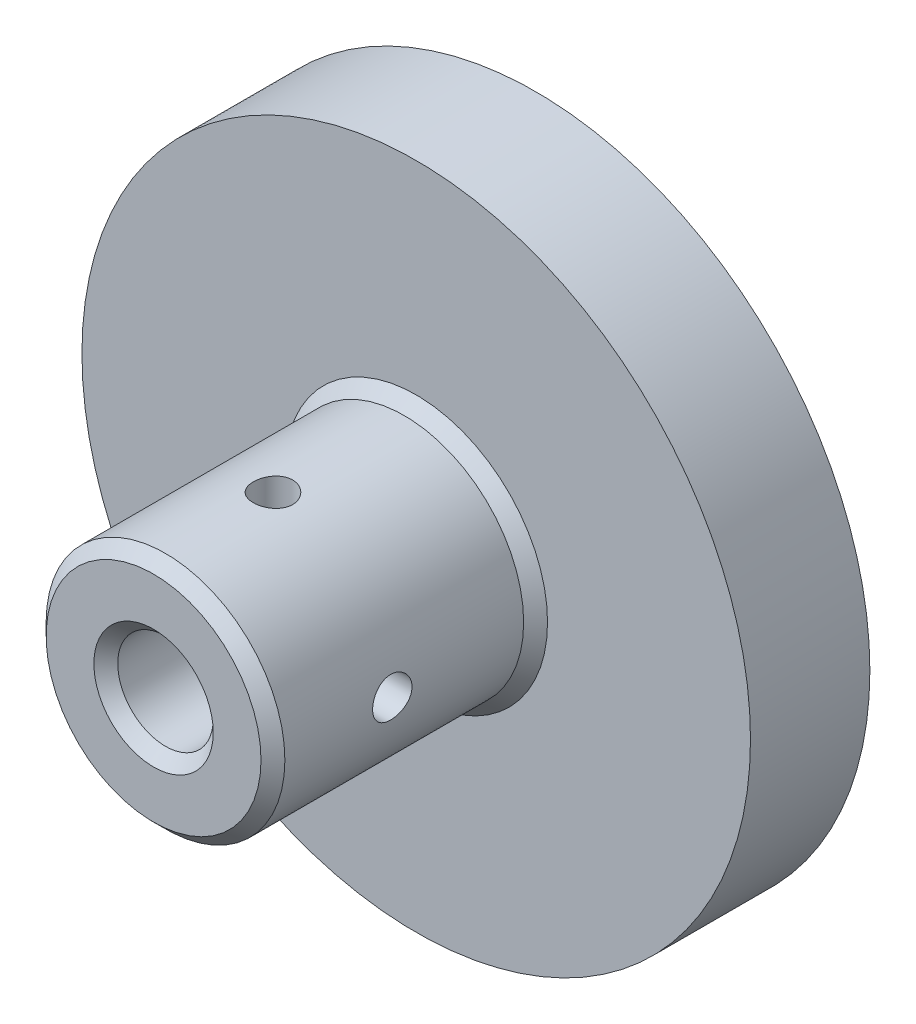
ISO-10303-21;
HEADER;
FILE_DESCRIPTION(('STEP AP214'),'2;1');
FILE_NAME('part.step','',(''),(''),'','','');
FILE_SCHEMA(('AUTOMOTIVE_DESIGN { 1 0 10303 214 1 1 1 1 }'));
ENDSEC;
DATA;
#1=APPLICATION_CONTEXT('core data for automotive mechanical design processes');
#2=APPLICATION_PROTOCOL_DEFINITION('international standard','automotive_design',2000,#1);
#3=PRODUCT_CONTEXT('',#1,'mechanical');
#4=PRODUCT('Part','Part','',(#3));
#5=PRODUCT_RELATED_PRODUCT_CATEGORY('part','',(#4));
#6=PRODUCT_DEFINITION_FORMATION('','',#4);
#7=PRODUCT_DEFINITION_CONTEXT('part definition',#1,'design');
#8=PRODUCT_DEFINITION('design','',#6,#7);
#9=PRODUCT_DEFINITION_SHAPE('','',#8);
#10=(LENGTH_UNIT() NAMED_UNIT(*) SI_UNIT(.MILLI.,.METRE.));
#11=(NAMED_UNIT(*) PLANE_ANGLE_UNIT() SI_UNIT($,.RADIAN.));
#12=(NAMED_UNIT(*) SI_UNIT($,.STERADIAN.) SOLID_ANGLE_UNIT());
#13=UNCERTAINTY_MEASURE_WITH_UNIT(LENGTH_MEASURE(1.E-05),#10,'distance_accuracy_value','');
#14=(GEOMETRIC_REPRESENTATION_CONTEXT(3) GLOBAL_UNCERTAINTY_ASSIGNED_CONTEXT((#13)) GLOBAL_UNIT_ASSIGNED_CONTEXT((#10,
#11,#12)) REPRESENTATION_CONTEXT('',''));
#15=CARTESIAN_POINT('',(0.,0.,0.));
#16=DIRECTION('',(0.,0.,1.));
#17=DIRECTION('',(1.,0.,0.));
#18=AXIS2_PLACEMENT_3D('',#15,#16,#17);
#19=CARTESIAN_POINT('',(0.,0.,10.));
#20=DIRECTION('',(0.,0.,-1.));
#21=DIRECTION('',(-1.,0.,0.));
#22=AXIS2_PLACEMENT_3D('',#19,#20,#21);
#23=CYLINDRICAL_SURFACE('',#22,28.);
#24=CARTESIAN_POINT('',(0.,0.,10.));
#25=DIRECTION('',(0.,0.,1.));
#26=DIRECTION('',(1.,0.,0.));
#27=AXIS2_PLACEMENT_3D('',#24,#25,#26);
#28=CIRCLE('',#27,28.);
#29=CARTESIAN_POINT('',(28.,0.,10.));
#30=VERTEX_POINT('',#29);
#31=EDGE_CURVE('E63',#30,#30,#28,.T.);
#32=ORIENTED_EDGE('',*,*,#31,.F.);
#33=EDGE_LOOP('',(#32));
#34=FACE_BOUND('',#33,.T.);
#35=CARTESIAN_POINT('',(0.,0.,0.));
#36=DIRECTION('',(0.,0.,1.));
#37=DIRECTION('',(1.,0.,0.));
#38=AXIS2_PLACEMENT_3D('',#35,#36,#37);
#39=CIRCLE('',#38,28.);
#40=CARTESIAN_POINT('',(28.,0.,0.));
#41=VERTEX_POINT('',#40);
#42=EDGE_CURVE('E64',#41,#41,#39,.T.);
#43=ORIENTED_EDGE('',*,*,#42,.T.);
#44=EDGE_LOOP('',(#43));
#45=FACE_BOUND('',#44,.T.);
#46=ADVANCED_FACE('F37',(#34,#45),#23,.T.);
#47=CARTESIAN_POINT('',(0.,0.,10.));
#48=DIRECTION('',(0.,0.,1.));
#49=DIRECTION('',(1.,0.,0.));
#50=AXIS2_PLACEMENT_3D('',#47,#48,#49);
#51=PLANE('',#50);
#52=CARTESIAN_POINT('',(0.,0.,10.));
#53=DIRECTION('',(0.,0.,1.));
#54=DIRECTION('',(1.,0.,0.));
#55=AXIS2_PLACEMENT_3D('',#52,#53,#54);
#56=CIRCLE('',#55,11.);
#57=CARTESIAN_POINT('',(11.,0.,10.));
#58=VERTEX_POINT('',#57);
#59=EDGE_CURVE('E10',#58,#58,#56,.F.);
#60=ORIENTED_EDGE('',*,*,#59,.T.);
#61=EDGE_LOOP('',(#60));
#62=FACE_BOUND('',#61,.T.);
#63=ORIENTED_EDGE('',*,*,#31,.T.);
#64=EDGE_LOOP('',(#63));
#65=FACE_BOUND('',#64,.T.);
#66=ADVANCED_FACE('F115',(#62,#65),#51,.T.);
#67=CARTESIAN_POINT('',(0.,0.,0.));
#68=DIRECTION('',(0.,0.,1.));
#69=DIRECTION('',(1.,0.,0.));
#70=AXIS2_PLACEMENT_3D('',#67,#68,#69);
#71=PLANE('',#70);
#72=CARTESIAN_POINT('',(0.,0.,0.));
#73=DIRECTION('',(0.,0.,1.));
#74=DIRECTION('',(1.,0.,0.));
#75=AXIS2_PLACEMENT_3D('',#72,#73,#74);
#76=CIRCLE('',#75,4.);
#77=CARTESIAN_POINT('',(4.,0.,0.));
#78=VERTEX_POINT('',#77);
#79=EDGE_CURVE('E67',#78,#78,#76,.T.);
#80=ORIENTED_EDGE('',*,*,#79,.T.);
#81=EDGE_LOOP('',(#80));
#82=FACE_BOUND('',#81,.T.);
#83=ORIENTED_EDGE('',*,*,#42,.F.);
#84=EDGE_LOOP('',(#83));
#85=FACE_BOUND('',#84,.T.);
#86=ADVANCED_FACE('F111',(#82,#85),#71,.F.);
#87=CARTESIAN_POINT('',(0.,0.,32.));
#88=DIRECTION('',(0.,0.,-1.));
#89=DIRECTION('',(-1.,0.,0.));
#90=AXIS2_PLACEMENT_3D('',#87,#88,#89);
#91=CYLINDRICAL_SURFACE('',#90,10.);
#92=CARTESIAN_POINT('',(10.,0.,20.35));
#93=CARTESIAN_POINT('',(9.99999843258099,-0.0920114531057513,20.3500037009853));
#94=CARTESIAN_POINT('',(9.99871684765511,-0.184073454347173,20.3577224586854));
#95=CARTESIAN_POINT('',(9.99372775496381,-0.36561632253533,20.3883812351379));
#96=CARTESIAN_POINT('',(9.99001800272159,-0.455094721351769,20.4113353369588));
#97=CARTESIAN_POINT('',(9.98058875631552,-0.628817487751617,20.4717536389359));
#98=CARTESIAN_POINT('',(9.974870893487,-0.713066038744489,20.5092060635603));
#99=CARTESIAN_POINT('',(9.96205444853338,-0.874072236504047,20.5975272541486));
#100=CARTESIAN_POINT('',(9.95495602786423,-0.950830757653335,20.648394451505));
#101=CARTESIAN_POINT('',(9.9400912001718,-1.09540879372213,20.7626087771329));
#102=CARTESIAN_POINT('',(9.93231968689365,-1.1631478788234,20.8260570636182));
#103=CARTESIAN_POINT('',(9.91702374723339,-1.28706950777736,20.9634147735932));
#104=CARTESIAN_POINT('',(9.90949933632427,-1.3432513290959,21.0373248506432));
#105=CARTESIAN_POINT('',(9.89550007731641,-1.44278500045255,21.1940593436766));
#106=CARTESIAN_POINT('',(9.88903182722124,-1.486057495709,21.2769347943439));
#107=CARTESIAN_POINT('',(9.87794796970923,-1.55803674048926,21.4489026252365));
#108=CARTESIAN_POINT('',(9.87333223970889,-1.58674445381558,21.5379945936492));
#109=CARTESIAN_POINT('',(9.86652679242373,-1.62852619503012,21.719014582001));
#110=CARTESIAN_POINT('',(9.86431555933323,-1.64173895927954,21.8109097556787));
#111=CARTESIAN_POINT('',(9.86250435770822,-1.6525858553069,21.9956373659234));
#112=CARTESIAN_POINT('',(9.86290420804218,-1.65022106770363,22.0884697370306));
#113=CARTESIAN_POINT('',(9.86625034802631,-1.63009303176281,22.2714472770567));
#114=CARTESIAN_POINT('',(9.86917088684506,-1.61248549472491,22.3616101140273));
#115=CARTESIAN_POINT('',(9.87718903199042,-1.56261607367814,22.5376840705334));
#116=CARTESIAN_POINT('',(9.88228671162732,-1.53035369619842,22.6235950467882));
#117=CARTESIAN_POINT('',(9.89411264039673,-1.45193210975576,22.7891935299244));
#118=CARTESIAN_POINT('',(9.90084846298693,-1.40570810605855,22.8688497892407));
#119=CARTESIAN_POINT('',(9.91518643931069,-1.30072141548382,23.0193343239077));
#120=CARTESIAN_POINT('',(9.92278866158315,-1.24195773629992,23.0901618999123));
#121=CARTESIAN_POINT('',(9.93811607123993,-1.11271072676608,23.2218799788826));
#122=CARTESIAN_POINT('',(9.94584163094155,-1.04209376928229,23.2826393946299));
#123=CARTESIAN_POINT('',(9.96045987838133,-0.891597059898627,23.3914660216062));
#124=CARTESIAN_POINT('',(9.9673525609492,-0.81171725050342,23.4395331540471));
#125=CARTESIAN_POINT('',(9.97953794169528,-0.644840083170818,23.5216221505343));
#126=CARTESIAN_POINT('',(9.98482933722618,-0.557837003156625,23.555632587638));
#127=CARTESIAN_POINT('',(9.99320544362233,-0.379246930002538,23.6085219127753));
#128=CARTESIAN_POINT('',(9.99629033536768,-0.28766031326089,23.6274020411448));
#129=CARTESIAN_POINT('',(9.99988156603306,-0.10363298381923,23.6493174611612));
#130=CARTESIAN_POINT('',(10.0004171933872,-0.0112142564119049,23.6525327361215));
#131=CARTESIAN_POINT('',(9.99892971175882,0.172841505554612,23.6435068013197));
#132=CARTESIAN_POINT('',(9.99690669920295,0.264478569441094,23.6312661740395));
#133=CARTESIAN_POINT('',(9.99054737820398,0.443814955541701,23.5918255972229));
#134=CARTESIAN_POINT('',(9.98622483070292,0.531534371938234,23.5647146056917));
#135=CARTESIAN_POINT('',(9.97574921956607,0.701182959294526,23.4963976074449));
#136=CARTESIAN_POINT('',(9.96959605484328,0.783111810188923,23.4551908223383));
#137=CARTESIAN_POINT('',(9.95606928426947,0.939636398877187,23.359438680501));
#138=CARTESIAN_POINT('',(9.94868555427359,1.01416235726441,23.3047807140829));
#139=CARTESIAN_POINT('',(9.93354765732488,1.15304841333202,23.1838328509312));
#140=CARTESIAN_POINT('',(9.92579346406183,1.2174077875821,23.1175421271457));
#141=CARTESIAN_POINT('',(9.91069407401677,1.33479962911466,22.9744038936717));
#142=CARTESIAN_POINT('',(9.90335382329476,1.38771058951938,22.8974561289012));
#143=CARTESIAN_POINT('',(9.89000528724129,1.47985547415611,22.7356589529326));
#144=CARTESIAN_POINT('',(9.88399696030452,1.51908982562642,22.6508097886681));
#145=CARTESIAN_POINT('',(9.87402953570154,1.58258535747081,22.4759604675969));
#146=CARTESIAN_POINT('',(9.87006212213644,1.60690737863644,22.3859829002034));
#147=CARTESIAN_POINT('',(9.86460473721113,1.64007952798871,22.2031486882195));
#148=CARTESIAN_POINT('',(9.86311455516769,1.64893097191814,22.1102922891519));
#149=CARTESIAN_POINT('',(9.86278931217107,1.65087457438791,21.9255493586982));
#150=CARTESIAN_POINT('',(9.86392203182987,1.6441579678695,21.8336648398079));
#151=CARTESIAN_POINT('',(9.86864441177183,1.61556925478543,21.6523522481362));
#152=CARTESIAN_POINT('',(9.87223406454433,1.59369719454883,21.5629241678464));
#153=CARTESIAN_POINT('',(9.88145370519206,1.53549112071354,21.3891347575646));
#154=CARTESIAN_POINT('',(9.8870814149876,1.49917324977363,21.3047678925491));
#155=CARTESIAN_POINT('',(9.89974533231771,1.41312606218932,21.1432937331397));
#156=CARTESIAN_POINT('',(9.90678160742253,1.36339610211419,21.0661867872723));
#157=CARTESIAN_POINT('',(9.92157214136343,1.25125259966704,20.9204545023623));
#158=CARTESIAN_POINT('',(9.92933379899766,1.18869826623125,20.8519382401805));
#159=CARTESIAN_POINT('',(9.94464125601211,1.05297867490408,20.7263094001233));
#160=CARTESIAN_POINT('',(9.95218700513286,0.97981097009266,20.6691994592198));
#161=CARTESIAN_POINT('',(9.96627143049841,0.824354696103038,20.5676525774265));
#162=CARTESIAN_POINT('',(9.97280295936929,0.742007852048179,20.523303852022));
#163=CARTESIAN_POINT('',(9.98405342047581,0.57095958692379,20.4491366471937));
#164=CARTESIAN_POINT('',(9.98877416450827,0.482264623543759,20.4193036358748));
#165=CARTESIAN_POINT('',(9.99483601455804,0.327682758240926,20.3815206584732));
#166=CARTESIAN_POINT('',(9.99676220083327,0.262733066711098,20.3697192511855));
#167=CARTESIAN_POINT('',(9.99934474465587,0.13186422762594,20.3539576610669));
#168=CARTESIAN_POINT('',(10.0000011233775,0.0659450962546684,20.3499973474842));
#169=CARTESIAN_POINT('',(10.,0.,20.35));
#170=B_SPLINE_CURVE_WITH_KNOTS('',3,(#92,#93,#94,#95,#96,#97,#98,#99,#100,#101,#102,#103,#104,
#105,#106,#107,#108,#109,#110,#111,#112,#113,#114,#115,#116,#117,#118,#119,#120,#121,#122,#123,
#124,#125,#126,#127,#128,#129,#130,#131,#132,#133,#134,#135,#136,#137,#138,#139,#140,#141,#142,
#143,#144,#145,#146,#147,#148,#149,#150,#151,#152,#153,#154,#155,#156,#157,#158,#159,#160,#161,
#162,#163,#164,#165,#166,#167,#168,#169),.UNSPECIFIED.,.T.,.F.,(4,2,2,2,2,2,2,2,2,2,2,2,2,2,2,2,
2,2,2,2,2,2,2,2,2,2,2,2,2,2,2,2,2,2,2,2,2,2,4),(0.,0.275793319008918,0.551841928312972,
0.8276667998706,1.10345943314171,1.38156673144316,1.65969141110741,1.93949209608633,
2.21927426326044,2.49653175525206,2.77377001402269,3.04820914252877,3.32265751287872,
3.59839967320042,3.87416366201706,4.1532757240192,4.43238951858747,4.71172976565332,
4.991047110928,5.26714751096616,5.54323750600189,5.81769359979004,6.09216485190803,
6.36901711215385,6.64588906369257,6.92556925596458,7.20524071063227,7.48376340648032,
7.76226241335696,8.03735855216245,8.31245385002402,8.58724259883659,8.86204453269316,
9.14004258759617,9.41810483731131,9.69804546871317,9.97770526783281,10.1753710978727,
10.3730336317698),.UNSPECIFIED.);
#171=CARTESIAN_POINT('',(10.,0.,20.35));
#172=VERTEX_POINT('',#171);
#173=EDGE_CURVE('E232',#172,#172,#170,.T.);
#174=ORIENTED_EDGE('',*,*,#173,.T.);
#175=EDGE_LOOP('',(#174));
#176=FACE_BOUND('',#175,.T.);
#177=CARTESIAN_POINT('',(0.,10.,23.65));
#178=CARTESIAN_POINT('',(-0.0920114531057509,9.99999843258099,23.6499962990147));
#179=CARTESIAN_POINT('',(-0.184073454347172,9.99871684765511,23.6422775413146));
#180=CARTESIAN_POINT('',(-0.365616322535328,9.99372775496381,23.6116187648621));
#181=CARTESIAN_POINT('',(-0.455094721351767,9.9900180027216,23.5886646630412));
#182=CARTESIAN_POINT('',(-0.628817487751612,9.98058875631552,23.5282463610641));
#183=CARTESIAN_POINT('',(-0.71306603874448,9.974870893487,23.4907939364397));
#184=CARTESIAN_POINT('',(-0.874072236504036,9.96205444853338,23.4024727458514));
#185=CARTESIAN_POINT('',(-0.950830757653324,9.95495602786423,23.351605548495));
#186=CARTESIAN_POINT('',(-1.09540879372212,9.9400912001718,23.2373912228671));
#187=CARTESIAN_POINT('',(-1.16314787882339,9.93231968689365,23.1739429363817));
#188=CARTESIAN_POINT('',(-1.28706950777735,9.9170237472334,23.0365852264068));
#189=CARTESIAN_POINT('',(-1.34325132909588,9.90949933632427,22.9626751493568));
#190=CARTESIAN_POINT('',(-1.44278500045253,9.89550007731641,22.8059406563233));
#191=CARTESIAN_POINT('',(-1.48605749570898,9.88903182722124,22.7230652056561));
#192=CARTESIAN_POINT('',(-1.55803674048924,9.87794796970923,22.5510973747635));
#193=CARTESIAN_POINT('',(-1.58674445381555,9.8733322397089,22.4620054063507));
#194=CARTESIAN_POINT('',(-1.62852619503009,9.86652679242373,22.280985417999));
#195=CARTESIAN_POINT('',(-1.64173895927951,9.86431555933323,22.1890902443212));
#196=CARTESIAN_POINT('',(-1.65258585530686,9.86250435770823,22.0043626340766));
#197=CARTESIAN_POINT('',(-1.65022106770359,9.86290420804218,21.9115302629694));
#198=CARTESIAN_POINT('',(-1.63009303176277,9.86625034802632,21.7285527229433));
#199=CARTESIAN_POINT('',(-1.61248549472487,9.86917088684506,21.6383898859726));
#200=CARTESIAN_POINT('',(-1.56261607367809,9.87718903199043,21.4623159294666));
#201=CARTESIAN_POINT('',(-1.53035369619838,9.88228671162733,21.3764049532117));
#202=CARTESIAN_POINT('',(-1.45193210975571,9.89411264039674,21.2108064700756));
#203=CARTESIAN_POINT('',(-1.4057081060585,9.90084846298694,21.1311502107593));
#204=CARTESIAN_POINT('',(-1.30072141548377,9.9151864393107,20.9806656760923));
#205=CARTESIAN_POINT('',(-1.24195773629987,9.92278866158316,20.9098381000877));
#206=CARTESIAN_POINT('',(-1.11271072676603,9.93811607123993,20.7781200211173));
#207=CARTESIAN_POINT('',(-1.04209376928222,9.94584163094155,20.7173606053701));
#208=CARTESIAN_POINT('',(-0.891597059898563,9.96045987838133,20.6085339783937));
#209=CARTESIAN_POINT('',(-0.811717250503355,9.9673525609492,20.5604668459529));
#210=CARTESIAN_POINT('',(-0.644840083170752,9.97953794169528,20.4783778494657));
#211=CARTESIAN_POINT('',(-0.557837003156558,9.98482933722619,20.444367412362));
#212=CARTESIAN_POINT('',(-0.37924693000247,9.99320544362233,20.3914780872247));
#213=CARTESIAN_POINT('',(-0.287660313260821,9.99629033536768,20.3725979588552));
#214=CARTESIAN_POINT('',(-0.103632983819161,9.99988156603306,20.3506825388388));
#215=CARTESIAN_POINT('',(-0.0112142564118364,10.0004171933872,20.3474672638785));
#216=CARTESIAN_POINT('',(0.17284150555468,9.99892971175882,20.3564931986803));
#217=CARTESIAN_POINT('',(0.264478569441162,9.99690669920295,20.3687338259605));
#218=CARTESIAN_POINT('',(0.443814955541767,9.99054737820398,20.4081744027771));
#219=CARTESIAN_POINT('',(0.531534371938299,9.98622483070291,20.4352853943084));
#220=CARTESIAN_POINT('',(0.70118295929459,9.97574921956607,20.5036023925551));
#221=CARTESIAN_POINT('',(0.783111810188987,9.96959605484327,20.5448091776617));
#222=CARTESIAN_POINT('',(0.939636398877249,9.95606928426946,20.640561319499));
#223=CARTESIAN_POINT('',(1.01416235726447,9.94868555427359,20.6952192859171));
#224=CARTESIAN_POINT('',(1.15304841333208,9.93354765732487,20.8161671490688));
#225=CARTESIAN_POINT('',(1.21740778758216,9.92579346406183,20.8824578728543));
#226=CARTESIAN_POINT('',(1.33479962911471,9.91069407401676,21.0255961063283));
#227=CARTESIAN_POINT('',(1.38771058951943,9.90335382329476,21.1025438710988));
#228=CARTESIAN_POINT('',(1.47985547415616,9.89000528724129,21.2643410470675));
#229=CARTESIAN_POINT('',(1.51908982562647,9.88399696030451,21.3491902113319));
#230=CARTESIAN_POINT('',(1.58258535747086,9.87402953570153,21.5240395324031));
#231=CARTESIAN_POINT('',(1.60690737863648,9.87006212213643,21.6140170997967));
#232=CARTESIAN_POINT('',(1.64007952798875,9.86460473721113,21.7968513117806));
#233=CARTESIAN_POINT('',(1.64893097191818,9.86311455516768,21.8897077108482));
#234=CARTESIAN_POINT('',(1.65087457438795,9.86278931217107,22.0744506413018));
#235=CARTESIAN_POINT('',(1.64415796786953,9.86392203182987,22.1663351601921));
#236=CARTESIAN_POINT('',(1.61556925478546,9.86864441177183,22.3476477518639));
#237=CARTESIAN_POINT('',(1.59369719454886,9.87223406454433,22.4370758321536));
#238=CARTESIAN_POINT('',(1.53549112071356,9.88145370519205,22.6108652424354));
#239=CARTESIAN_POINT('',(1.49917324977365,9.88708141498759,22.695232107451));
#240=CARTESIAN_POINT('',(1.41312606218934,9.89974533231771,22.8567062668603));
#241=CARTESIAN_POINT('',(1.36339610211421,9.90678160742252,22.9338132127277));
#242=CARTESIAN_POINT('',(1.25125259966706,9.92157214136343,23.0795454976377));
#243=CARTESIAN_POINT('',(1.18869826623126,9.92933379899765,23.1480617598196));
#244=CARTESIAN_POINT('',(1.05297867490409,9.94464125601211,23.2736905998767));
#245=CARTESIAN_POINT('',(0.979810970092669,9.95218700513286,23.3308005407802));
#246=CARTESIAN_POINT('',(0.824354696103044,9.96627143049842,23.4323474225735));
#247=CARTESIAN_POINT('',(0.742007852048184,9.97280295936929,23.476696147978));
#248=CARTESIAN_POINT('',(0.570959586923792,9.98405342047581,23.5508633528063));
#249=CARTESIAN_POINT('',(0.482264623543761,9.98877416450827,23.5806963641252));
#250=CARTESIAN_POINT('',(0.327682758240928,9.99483601455804,23.6184793415268));
#251=CARTESIAN_POINT('',(0.2627330667111,9.99676220083327,23.6302807488145));
#252=CARTESIAN_POINT('',(0.131864227625941,9.99934474465587,23.6460423389331));
#253=CARTESIAN_POINT('',(0.065945096254669,10.0000011233775,23.6500026525158));
#254=CARTESIAN_POINT('',(0.,10.,23.65));
#255=B_SPLINE_CURVE_WITH_KNOTS('',3,(#177,#178,#179,#180,#181,#182,#183,#184,#185,#186,#187,
#188,#189,#190,#191,#192,#193,#194,#195,#196,#197,#198,#199,#200,#201,#202,#203,#204,#205,#206,
#207,#208,#209,#210,#211,#212,#213,#214,#215,#216,#217,#218,#219,#220,#221,#222,#223,#224,#225,
#226,#227,#228,#229,#230,#231,#232,#233,#234,#235,#236,#237,#238,#239,#240,#241,#242,#243,#244,
#245,#246,#247,#248,#249,#250,#251,#252,#253,#254),.UNSPECIFIED.,.T.,.F.,(4,2,2,2,2,2,2,2,2,2,2,
2,2,2,2,2,2,2,2,2,2,2,2,2,2,2,2,2,2,2,2,2,2,2,2,2,2,2,4),(0.,0.275793319008917,
0.551841928312971,0.827666799870593,1.1034594331417,1.38156673144315,1.65969141110741,
1.93949209608633,2.21927426326044,2.49653175525206,2.77377001402269,3.04820914252876,
3.32265751287871,3.59839967320041,3.87416366201706,4.1532757240192,4.43238951858747,
4.71172976565331,4.991047110928,5.26714751096616,5.54323750600189,5.81769359979003,
6.09216485190802,6.36901711215385,6.64588906369257,6.92556925596458,7.20524071063227,
7.48376340648031,7.76226241335695,8.03735855216244,8.31245385002402,8.58724259883658,
8.86204453269315,9.14004258759616,9.4181048373113,9.69804546871317,9.9777052678328,
10.1753710978727,10.3730336317698),.UNSPECIFIED.);
#256=CARTESIAN_POINT('',(0.,10.,23.65));
#257=VERTEX_POINT('',#256);
#258=EDGE_CURVE('E72',#257,#257,#255,.T.);
#259=ORIENTED_EDGE('',*,*,#258,.T.);
#260=EDGE_LOOP('',(#259));
#261=FACE_BOUND('',#260,.T.);
#262=CARTESIAN_POINT('',(0.,0.,11.));
#263=DIRECTION('',(0.,0.,1.));
#264=DIRECTION('',(1.,0.,0.));
#265=AXIS2_PLACEMENT_3D('',#262,#263,#264);
#266=CIRCLE('',#265,10.);
#267=CARTESIAN_POINT('',(10.,0.,11.));
#268=VERTEX_POINT('',#267);
#269=EDGE_CURVE('E44',#268,#268,#266,.T.);
#270=ORIENTED_EDGE('',*,*,#269,.T.);
#271=EDGE_LOOP('',(#270));
#272=FACE_BOUND('',#271,.T.);
#273=CARTESIAN_POINT('',(0.,0.,31.));
#274=DIRECTION('',(0.,0.,1.));
#275=DIRECTION('',(1.,0.,0.));
#276=AXIS2_PLACEMENT_3D('',#273,#274,#275);
#277=CIRCLE('',#276,10.);
#278=CARTESIAN_POINT('',(10.,0.,31.));
#279=VERTEX_POINT('',#278);
#280=EDGE_CURVE('E48',#279,#279,#277,.F.);
#281=ORIENTED_EDGE('',*,*,#280,.T.);
#282=EDGE_LOOP('',(#281));
#283=FACE_BOUND('',#282,.T.);
#284=ADVANCED_FACE('F86',(#176,#261,#272,#283),#91,.T.);
#285=CARTESIAN_POINT('',(0.,0.,32.));
#286=DIRECTION('',(0.,0.,1.));
#287=DIRECTION('',(1.,0.,0.));
#288=AXIS2_PLACEMENT_3D('',#285,#286,#287);
#289=PLANE('',#288);
#290=CARTESIAN_POINT('',(0.,0.,32.));
#291=DIRECTION('',(0.,0.,1.));
#292=DIRECTION('',(1.,0.,0.));
#293=AXIS2_PLACEMENT_3D('',#290,#291,#292);
#294=CIRCLE('',#293,5.00000000000001);
#295=CARTESIAN_POINT('',(5.00000000000001,0.,32.));
#296=VERTEX_POINT('',#295);
#297=EDGE_CURVE('E52',#296,#296,#294,.F.);
#298=ORIENTED_EDGE('',*,*,#297,.T.);
#299=EDGE_LOOP('',(#298));
#300=FACE_BOUND('',#299,.T.);
#301=CARTESIAN_POINT('',(0.,0.,32.));
#302=DIRECTION('',(0.,0.,1.));
#303=DIRECTION('',(1.,0.,0.));
#304=AXIS2_PLACEMENT_3D('',#301,#302,#303);
#305=CIRCLE('',#304,9.);
#306=CARTESIAN_POINT('',(9.,0.,32.));
#307=VERTEX_POINT('',#306);
#308=EDGE_CURVE('E57',#307,#307,#305,.T.);
#309=ORIENTED_EDGE('',*,*,#308,.T.);
#310=EDGE_LOOP('',(#309));
#311=FACE_BOUND('',#310,.T.);
#312=ADVANCED_FACE('F104',(#300,#311),#289,.T.);
#313=CARTESIAN_POINT('',(0.,0.,0.));
#314=DIRECTION('',(0.,0.,1.));
#315=DIRECTION('',(1.,0.,0.));
#316=AXIS2_PLACEMENT_3D('',#313,#314,#315);
#317=CYLINDRICAL_SURFACE('',#316,4.);
#318=CARTESIAN_POINT('',(4.,0.,20.35));
#319=CARTESIAN_POINT('',(3.99999309817074,0.0884596783632789,20.3500092172066));
#320=CARTESIAN_POINT('',(3.99703145792172,0.177062252057582,20.3571560143433));
#321=CARTESIAN_POINT('',(3.9854711320255,0.351759669836408,20.3854911419369));
#322=CARTESIAN_POINT('',(3.97685757767607,0.437847271996958,20.4067165110243));
#323=CARTESIAN_POINT('',(3.95491965529936,0.604702496902737,20.4622948122019));
#324=CARTESIAN_POINT('',(3.94161112398211,0.685486934491192,20.4966036433535));
#325=CARTESIAN_POINT('',(3.91158286286531,0.840076633223481,20.5771947578495));
#326=CARTESIAN_POINT('',(3.89486420463244,0.913884076117558,20.6234732811702));
#327=CARTESIAN_POINT('',(3.85876900012149,1.05618769598524,20.7291067546441));
#328=CARTESIAN_POINT('',(3.83930654387258,1.12429373957475,20.788957670249));
#329=CARTESIAN_POINT('',(3.80029483347099,1.24983574384756,20.918988839659));
#330=CARTESIAN_POINT('',(3.78074553976623,1.30726618926956,20.9891743992118));
#331=CARTESIAN_POINT('',(3.74272551686067,1.41254826809048,21.1419682488717));
#332=CARTESIAN_POINT('',(3.72435159658093,1.45980781790559,21.2250111153066));
#333=CARTESIAN_POINT('',(3.69212136090387,1.53951358199404,21.3987363092902));
#334=CARTESIAN_POINT('',(3.67826276509116,1.57196727712788,21.4894147513631));
#335=CARTESIAN_POINT('',(3.65756021871624,1.61953738222489,21.6713479970019));
#336=CARTESIAN_POINT('',(3.65041449103238,1.6354037141715,21.7623710721431));
#337=CARTESIAN_POINT('',(3.64307714795705,1.65168918120799,21.9460465073653));
#338=CARTESIAN_POINT('',(3.6428818057274,1.65211659473996,22.0386979676293));
#339=CARTESIAN_POINT('',(3.64921138579607,1.63807780779826,22.2155988866188));
#340=CARTESIAN_POINT('',(3.65523439741042,1.62472398487454,22.2999581587492));
#341=CARTESIAN_POINT('',(3.67247532251839,1.58536484231193,22.4651102843812));
#342=CARTESIAN_POINT('',(3.68369420783861,1.5593571558718,22.5459024676033));
#343=CARTESIAN_POINT('',(3.71031458481433,1.49492412942483,22.7036451087586));
#344=CARTESIAN_POINT('',(3.72579923184193,1.45624866973011,22.7804787378084));
#345=CARTESIAN_POINT('',(3.75918616236909,1.36775445443618,22.9268602324601));
#346=CARTESIAN_POINT('',(3.77708938726887,1.31793135478153,22.9964052422492));
#347=CARTESIAN_POINT('',(3.81509742396097,1.20371911924862,23.1322864077878));
#348=CARTESIAN_POINT('',(3.83526188253692,1.13846630094382,23.1978819577033));
#349=CARTESIAN_POINT('',(3.87426910607355,0.997682554866143,23.3174446744414));
#350=CARTESIAN_POINT('',(3.89311157289531,0.922149319847359,23.3714092238609));
#351=CARTESIAN_POINT('',(3.92787932271739,0.760736369737248,23.4672347735851));
#352=CARTESIAN_POINT('',(3.94373050716792,0.67466409407216,23.5088002831942));
#353=CARTESIAN_POINT('',(3.97016319816606,0.495928253552899,23.5766030241089));
#354=CARTESIAN_POINT('',(3.98074755693755,0.403268287372308,23.6028485532112));
#355=CARTESIAN_POINT('',(3.99492450637935,0.220181304317597,23.6377295036782));
#356=CARTESIAN_POINT('',(3.99891121146316,0.129974172308146,23.6473591779359));
#357=CARTESIAN_POINT('',(4.00069746426785,-0.0508474401522959,23.6516920437633));
#358=CARTESIAN_POINT('',(3.99849874371343,-0.141461799500638,23.6463994131082));
#359=CARTESIAN_POINT('',(3.98841747083846,-0.315907755487618,23.621754731757));
#360=CARTESIAN_POINT('',(3.98081531688809,-0.399855317526753,23.6030959266599));
#361=CARTESIAN_POINT('',(3.9609888780309,-0.563340473329641,23.5532079036629));
#362=CARTESIAN_POINT('',(3.94876400644331,-0.642877505872212,23.5219770901852));
#363=CARTESIAN_POINT('',(3.92039728883463,-0.798061975964539,23.4468106200191));
#364=CARTESIAN_POINT('',(3.90414585630854,-0.87351265666057,23.4025114382438));
#365=CARTESIAN_POINT('',(3.86946768187547,-1.01617847320913,23.3028660657421));
#366=CARTESIAN_POINT('',(3.85104004134397,-1.08339018342116,23.2475153049101));
#367=CARTESIAN_POINT('',(3.81240295844538,-1.21261994292747,23.122795695188));
#368=CARTESIAN_POINT('',(3.7921591649383,-1.27394364561828,23.0527161759607));
#369=CARTESIAN_POINT('',(3.75333928940829,-1.38414835482511,22.9029287093914));
#370=CARTESIAN_POINT('',(3.73476355904107,-1.43302674162732,22.8232187400574));
#371=CARTESIAN_POINT('',(3.70128700339841,-1.51742282291392,22.6549046294666));
#372=CARTESIAN_POINT('',(3.68643724424494,-1.55275802936539,22.5661980839919));
#373=CARTESIAN_POINT('',(3.66281640168179,-1.60769618165397,22.3832908340217));
#374=CARTESIAN_POINT('',(3.65404044124934,-1.62731175174757,22.2890946035818));
#375=CARTESIAN_POINT('',(3.64429559365238,-1.64901123940271,22.1055697268419));
#376=CARTESIAN_POINT('',(3.64278573581522,-1.65231049364128,22.016412780542));
#377=CARTESIAN_POINT('',(3.64631178238902,-1.6445148535657,21.8388715292408));
#378=CARTESIAN_POINT('',(3.65134672892695,-1.63342206561732,21.7504871130806));
#379=CARTESIAN_POINT('',(3.66690490418699,-1.59817118006574,21.5810669287423));
#380=CARTESIAN_POINT('',(3.6771726120025,-1.57461958437456,21.4998792885779));
#381=CARTESIAN_POINT('',(3.70184411206583,-1.51570599472929,21.3425854775259));
#382=CARTESIAN_POINT('',(3.7162490615217,-1.48034069596894,21.2664807357024));
#383=CARTESIAN_POINT('',(3.7486340889516,-1.39638062253792,21.1165779617586));
#384=CARTESIAN_POINT('',(3.76677577854002,-1.34712443599272,21.0431859289786));
#385=CARTESIAN_POINT('',(3.80412864636709,-1.23771718137823,20.9053283127357));
#386=CARTESIAN_POINT('',(3.82334018195056,-1.17756245772963,20.8408657372256));
#387=CARTESIAN_POINT('',(3.86230172013188,-1.04300738755744,20.7180058612963));
#388=CARTESIAN_POINT('',(3.88199359359226,-0.967900110730178,20.6603607763945));
#389=CARTESIAN_POINT('',(3.91832426905579,-0.808343463182033,20.5584598404613));
#390=CARTESIAN_POINT('',(3.9349616732268,-0.723889843442849,20.5142101136341));
#391=CARTESIAN_POINT('',(3.96305691394126,-0.549414760109626,20.4413362601652));
#392=CARTESIAN_POINT('',(3.97459855421812,-0.459513381649423,20.4124575746414));
#393=CARTESIAN_POINT('',(3.99154438775475,-0.27571922921324,20.3704889152149));
#394=CARTESIAN_POINT('',(3.99696786149576,-0.181839966818027,20.3573493337546));
#395=CARTESIAN_POINT('',(3.99968194626838,-0.0584442952271949,20.35077322967));
#396=CARTESIAN_POINT('',(4.00000228058838,-0.0292299486703373,20.3499969543358));
#397=CARTESIAN_POINT('',(4.,0.,20.35));
#398=B_SPLINE_CURVE_WITH_KNOTS('',3,(#318,#319,#320,#321,#322,#323,#324,#325,#326,#327,#328,
#329,#330,#331,#332,#333,#334,#335,#336,#337,#338,#339,#340,#341,#342,#343,#344,#345,#346,#347,
#348,#349,#350,#351,#352,#353,#354,#355,#356,#357,#358,#359,#360,#361,#362,#363,#364,#365,#366,
#367,#368,#369,#370,#371,#372,#373,#374,#375,#376,#377,#378,#379,#380,#381,#382,#383,#384,#385,
#386,#387,#388,#389,#390,#391,#392,#393,#394,#395,#396,#397),.UNSPECIFIED.,.T.,.F.,(4,2,2,2,2,2,
2,2,2,2,2,2,2,2,2,2,2,2,2,2,2,2,2,2,2,2,2,2,2,2,2,2,2,2,2,2,2,2,2,4),(0.,0.26529709877062,
0.531294937906659,0.79640398149888,1.06142984766523,1.33841878994456,1.61555043582129,
1.90598404924538,2.19627075414924,2.4727764853942,2.74913395037958,3.00480633611682,
3.26052656166859,3.5216353930134,3.78284615202014,4.06565185095455,4.34852112528508,
4.63767392136375,4.92666995726766,5.19768149557684,5.46861716672803,5.72643264660552,
5.98428085748382,6.25011488704504,6.51605907418431,6.80064580250401,7.08529238632157,
7.3736498522578,7.66177550895674,7.92807823226722,8.19434198489782,8.44869772098557,
8.70312467109942,8.97267479984707,9.24231550885211,9.5310408581654,9.81989801073176,
10.1038095613048,10.3868238858898,10.4744866574818),.UNSPECIFIED.);
#399=CARTESIAN_POINT('',(4.,0.,20.35));
#400=VERTEX_POINT('',#399);
#401=EDGE_CURVE('E228',#400,#400,#398,.T.);
#402=ORIENTED_EDGE('',*,*,#401,.T.);
#403=EDGE_LOOP('',(#402));
#404=FACE_BOUND('',#403,.T.);
#405=CARTESIAN_POINT('',(0.,4.,23.65));
#406=CARTESIAN_POINT('',(0.0884596783632783,3.99999309817074,23.6499907827934));
#407=CARTESIAN_POINT('',(0.177062252057581,3.99703145792172,23.6428439856567));
#408=CARTESIAN_POINT('',(0.351759669836407,3.9854711320255,23.6145088580631));
#409=CARTESIAN_POINT('',(0.437847271996959,3.97685757767606,23.5932834889757));
#410=CARTESIAN_POINT('',(0.604702496902738,3.95491965529936,23.5377051877981));
#411=CARTESIAN_POINT('',(0.685486934491192,3.94161112398211,23.5033963566465));
#412=CARTESIAN_POINT('',(0.840076633223482,3.91158286286531,23.4228052421506));
#413=CARTESIAN_POINT('',(0.913884076117562,3.89486420463244,23.3765267188298));
#414=CARTESIAN_POINT('',(1.05618769598525,3.85876900012149,23.2708932453559));
#415=CARTESIAN_POINT('',(1.12429373957476,3.83930654387258,23.211042329751));
#416=CARTESIAN_POINT('',(1.24983574384756,3.80029483347099,23.081011160341));
#417=CARTESIAN_POINT('',(1.30726618926956,3.78074553976622,23.0108256007882));
#418=CARTESIAN_POINT('',(1.41254826809049,3.74272551686067,22.8580317511283));
#419=CARTESIAN_POINT('',(1.45980781790561,3.72435159658093,22.7749888846935));
#420=CARTESIAN_POINT('',(1.53951358199406,3.69212136090386,22.6012636907098));
#421=CARTESIAN_POINT('',(1.5719672771279,3.67826276509115,22.510585248637));
#422=CARTESIAN_POINT('',(1.61953738222491,3.65756021871623,22.3286520029982));
#423=CARTESIAN_POINT('',(1.63540371417153,3.65041449103237,22.2376289278569));
#424=CARTESIAN_POINT('',(1.65168918120802,3.64307714795703,22.0539534926347));
#425=CARTESIAN_POINT('',(1.65211659474,3.64288180572738,21.9613020323707));
#426=CARTESIAN_POINT('',(1.6380778077983,3.64921138579605,21.7844011133813));
#427=CARTESIAN_POINT('',(1.62472398487458,3.6552343974104,21.7000418412508));
#428=CARTESIAN_POINT('',(1.58536484231197,3.67247532251837,21.5348897156188));
#429=CARTESIAN_POINT('',(1.55935715587184,3.68369420783859,21.4540975323967));
#430=CARTESIAN_POINT('',(1.49492412942488,3.71031458481431,21.2963548912414));
#431=CARTESIAN_POINT('',(1.45624866973016,3.72579923184191,21.2195212621917));
#432=CARTESIAN_POINT('',(1.36775445443624,3.75918616236907,21.07313976754));
#433=CARTESIAN_POINT('',(1.31793135478159,3.77708938726885,21.0035947577509));
#434=CARTESIAN_POINT('',(1.20371911924869,3.81509742396095,20.8677135922122));
#435=CARTESIAN_POINT('',(1.13846630094388,3.8352618825369,20.8021180422967));
#436=CARTESIAN_POINT('',(0.997682554866212,3.87426910607353,20.6825553255586));
#437=CARTESIAN_POINT('',(0.922149319847431,3.8931115728953,20.6285907761392));
#438=CARTESIAN_POINT('',(0.760736369737323,3.92787932271737,20.532765226415));
#439=CARTESIAN_POINT('',(0.674664094072236,3.94373050716791,20.4911997168058));
#440=CARTESIAN_POINT('',(0.495928253552977,3.97016319816605,20.4233969758911));
#441=CARTESIAN_POINT('',(0.403268287372385,3.98074755693754,20.3971514467888));
#442=CARTESIAN_POINT('',(0.220181304317674,3.99492450637935,20.3622704963218));
#443=CARTESIAN_POINT('',(0.129974172308223,3.99891121146315,20.3526408220641));
#444=CARTESIAN_POINT('',(-0.0508474401522209,4.00069746426785,20.3483079562367));
#445=CARTESIAN_POINT('',(-0.141461799500565,3.99849874371343,20.3536005868918));
#446=CARTESIAN_POINT('',(-0.315907755487546,3.98841747083847,20.378245268243));
#447=CARTESIAN_POINT('',(-0.399855317526683,3.9808153168881,20.3969040733401));
#448=CARTESIAN_POINT('',(-0.563340473329572,3.96098887803091,20.4467920963371));
#449=CARTESIAN_POINT('',(-0.642877505872143,3.94876400644332,20.4780229098148));
#450=CARTESIAN_POINT('',(-0.798061975964472,3.92039728883464,20.5531893799809));
#451=CARTESIAN_POINT('',(-0.873512656660503,3.90414585630856,20.5974885617562));
#452=CARTESIAN_POINT('',(-1.01617847320907,3.86946768187548,20.6971339342579));
#453=CARTESIAN_POINT('',(-1.0833901834211,3.85104004134398,20.7524846950898));
#454=CARTESIAN_POINT('',(-1.21261994292741,3.8124029584454,20.877204304812));
#455=CARTESIAN_POINT('',(-1.27394364561821,3.79215916493832,20.9472838240393));
#456=CARTESIAN_POINT('',(-1.38414835482505,3.75333928940831,21.0970712906085));
#457=CARTESIAN_POINT('',(-1.43302674162726,3.73476355904109,21.1767812599426));
#458=CARTESIAN_POINT('',(-1.51742282291387,3.70128700339843,21.3450953705333));
#459=CARTESIAN_POINT('',(-1.55275802936534,3.68643724424496,21.4338019160081));
#460=CARTESIAN_POINT('',(-1.60769618165393,3.66281640168181,21.6167091659782));
#461=CARTESIAN_POINT('',(-1.62731175174752,3.65404044124936,21.7109053964182));
#462=CARTESIAN_POINT('',(-1.64901123940267,3.64429559365239,21.8944302731581));
#463=CARTESIAN_POINT('',(-1.65231049364124,3.64278573581524,21.9835872194579));
#464=CARTESIAN_POINT('',(-1.64451485356567,3.64631178238903,22.1611284707592));
#465=CARTESIAN_POINT('',(-1.63342206561729,3.65134672892697,22.2495128869194));
#466=CARTESIAN_POINT('',(-1.59817118006571,3.666904904187,22.4189330712577));
#467=CARTESIAN_POINT('',(-1.57461958437453,3.67717261200251,22.5001207114221));
#468=CARTESIAN_POINT('',(-1.51570599472927,3.70184411206584,22.6574145224741));
#469=CARTESIAN_POINT('',(-1.48034069596892,3.71624906152171,22.7335192642976));
#470=CARTESIAN_POINT('',(-1.3963806225379,3.7486340889516,22.8834220382414));
#471=CARTESIAN_POINT('',(-1.34712443599271,3.76677577854003,22.9568140710214));
#472=CARTESIAN_POINT('',(-1.23771718137822,3.80412864636709,23.0946716872643));
#473=CARTESIAN_POINT('',(-1.17756245772962,3.82334018195057,23.1591342627744));
#474=CARTESIAN_POINT('',(-1.04300738755743,3.86230172013188,23.2819941387037));
#475=CARTESIAN_POINT('',(-0.967900110730173,3.88199359359226,23.3396392236055));
#476=CARTESIAN_POINT('',(-0.808343463182031,3.91832426905579,23.4415401595387));
#477=CARTESIAN_POINT('',(-0.723889843442847,3.9349616732268,23.4857898863659));
#478=CARTESIAN_POINT('',(-0.549414760109625,3.96305691394126,23.5586637398347));
#479=CARTESIAN_POINT('',(-0.459513381649424,3.97459855421812,23.5875424253585));
#480=CARTESIAN_POINT('',(-0.275719229213242,3.99154438775475,23.6295110847851));
#481=CARTESIAN_POINT('',(-0.18183996681803,3.99696786149576,23.6426506662454));
#482=CARTESIAN_POINT('',(-0.0584442952271974,3.99968194626838,23.64922677033));
#483=CARTESIAN_POINT('',(-0.0292299486703385,4.00000228058838,23.6500030456642));
#484=CARTESIAN_POINT('',(0.,4.,23.65));
#485=B_SPLINE_CURVE_WITH_KNOTS('',3,(#405,#406,#407,#408,#409,#410,#411,#412,#413,#414,#415,
#416,#417,#418,#419,#420,#421,#422,#423,#424,#425,#426,#427,#428,#429,#430,#431,#432,#433,#434,
#435,#436,#437,#438,#439,#440,#441,#442,#443,#444,#445,#446,#447,#448,#449,#450,#451,#452,#453,
#454,#455,#456,#457,#458,#459,#460,#461,#462,#463,#464,#465,#466,#467,#468,#469,#470,#471,#472,
#473,#474,#475,#476,#477,#478,#479,#480,#481,#482,#483,#484),.UNSPECIFIED.,.T.,.F.,(4,2,2,2,2,2,
2,2,2,2,2,2,2,2,2,2,2,2,2,2,2,2,2,2,2,2,2,2,2,2,2,2,2,2,2,2,2,2,2,4),(0.,0.265297098770618,
0.531294937906658,0.796403981498876,1.06142984766522,1.33841878994456,1.61555043582129,
1.90598404924537,2.19627075414924,2.4727764853942,2.74913395037959,3.00480633611682,
3.2605265616686,3.5216353930134,3.78284615202013,4.06565185095454,4.34852112528507,
4.63767392136374,4.92666995726766,5.19768149557684,5.46861716672803,5.72643264660552,
5.98428085748382,6.25011488704504,6.5160590741843,6.800645802504,7.08529238632156,
7.37364985225779,7.66177550895673,7.92807823226721,8.19434198489782,8.44869772098557,
8.70312467109942,8.97267479984707,9.2423155088521,9.53104085816539,9.81989801073176,
10.1038095613048,10.3868238858898,10.4744866574817),.UNSPECIFIED.);
#486=CARTESIAN_POINT('',(0.,4.,23.65));
#487=VERTEX_POINT('',#486);
#488=EDGE_CURVE('E80',#487,#487,#485,.T.);
#489=ORIENTED_EDGE('',*,*,#488,.T.);
#490=EDGE_LOOP('',(#489));
#491=FACE_BOUND('',#490,.T.);
#492=CARTESIAN_POINT('',(0.,0.,31.));
#493=DIRECTION('',(0.,0.,1.));
#494=DIRECTION('',(1.,0.,0.));
#495=AXIS2_PLACEMENT_3D('',#492,#493,#494);
#496=CIRCLE('',#495,4.);
#497=CARTESIAN_POINT('',(4.,0.,31.));
#498=VERTEX_POINT('',#497);
#499=EDGE_CURVE('E60',#498,#498,#496,.T.);
#500=ORIENTED_EDGE('',*,*,#499,.T.);
#501=EDGE_LOOP('',(#500));
#502=FACE_BOUND('',#501,.T.);
#503=ORIENTED_EDGE('',*,*,#79,.F.);
#504=EDGE_LOOP('',(#503));
#505=FACE_BOUND('',#504,.T.);
#506=ADVANCED_FACE('F101',(#404,#491,#502,#505),#317,.F.);
#507=CARTESIAN_POINT('',(0.,0.,31.));
#508=DIRECTION('',(0.,0.,1.));
#509=DIRECTION('',(1.,0.,0.));
#510=AXIS2_PLACEMENT_3D('',#507,#508,#509);
#511=CONICAL_SURFACE('',#510,4.,0.785398163397452);
#512=ORIENTED_EDGE('',*,*,#297,.F.);
#513=EDGE_LOOP('',(#512));
#514=FACE_BOUND('',#513,.T.);
#515=ORIENTED_EDGE('',*,*,#499,.F.);
#516=EDGE_LOOP('',(#515));
#517=FACE_BOUND('',#516,.T.);
#518=ADVANCED_FACE('F103',(#514,#517),#511,.F.);
#519=CARTESIAN_POINT('',(0.,0.,11.));
#520=DIRECTION('',(0.,0.,-1.));
#521=DIRECTION('',(-1.,0.,0.));
#522=AXIS2_PLACEMENT_3D('',#519,#520,#521);
#523=CONICAL_SURFACE('',#522,10.,0.785398163397446);
#524=ORIENTED_EDGE('',*,*,#59,.F.);
#525=EDGE_LOOP('',(#524));
#526=FACE_BOUND('',#525,.T.);
#527=ORIENTED_EDGE('',*,*,#269,.F.);
#528=EDGE_LOOP('',(#527));
#529=FACE_BOUND('',#528,.T.);
#530=ADVANCED_FACE('F126',(#526,#529),#523,.T.);
#531=CARTESIAN_POINT('',(0.,0.,32.));
#532=DIRECTION('',(0.,0.,-1.));
#533=DIRECTION('',(-1.,0.,0.));
#534=AXIS2_PLACEMENT_3D('',#531,#532,#533);
#535=CONICAL_SURFACE('',#534,9.,0.785398163397447);
#536=ORIENTED_EDGE('',*,*,#280,.F.);
#537=EDGE_LOOP('',(#536));
#538=FACE_BOUND('',#537,.T.);
#539=ORIENTED_EDGE('',*,*,#308,.F.);
#540=EDGE_LOOP('',(#539));
#541=FACE_BOUND('',#540,.T.);
#542=ADVANCED_FACE('F39',(#538,#541),#535,.T.);
#543=CARTESIAN_POINT('',(0.,10.,22.));
#544=DIRECTION('',(0.,1.,0.));
#545=DIRECTION('',(0.,0.,1.));
#546=AXIS2_PLACEMENT_3D('',#543,#544,#545);
#547=CYLINDRICAL_SURFACE('',#546,1.64999999999999);
#548=ORIENTED_EDGE('',*,*,#488,.F.);
#549=EDGE_LOOP('',(#548));
#550=FACE_BOUND('',#549,.T.);
#551=ORIENTED_EDGE('',*,*,#258,.F.);
#552=EDGE_LOOP('',(#551));
#553=FACE_BOUND('',#552,.T.);
#554=ADVANCED_FACE('F90',(#550,#553),#547,.F.);
#555=CARTESIAN_POINT('',(10.,0.,22.));
#556=DIRECTION('',(1.,0.,0.));
#557=DIRECTION('',(0.,0.,-1.));
#558=AXIS2_PLACEMENT_3D('',#555,#556,#557);
#559=CYLINDRICAL_SURFACE('',#558,1.64999999999999);
#560=ORIENTED_EDGE('',*,*,#401,.F.);
#561=EDGE_LOOP('',(#560));
#562=FACE_BOUND('',#561,.T.);
#563=ORIENTED_EDGE('',*,*,#173,.F.);
#564=EDGE_LOOP('',(#563));
#565=FACE_BOUND('',#564,.T.);
#566=ADVANCED_FACE('F94',(#562,#565),#559,.F.);
#567=CLOSED_SHELL('',(#46,#66,#86,#284,#312,#506,#518,#530,#542,#554,#566));
#568=MANIFOLD_SOLID_BREP('B2',#567);
#569=ADVANCED_BREP_SHAPE_REPRESENTATION('',(#18,#568),#14);
#570=SHAPE_DEFINITION_REPRESENTATION(#9,#569);
ENDSEC;
END-ISO-10303-21;
